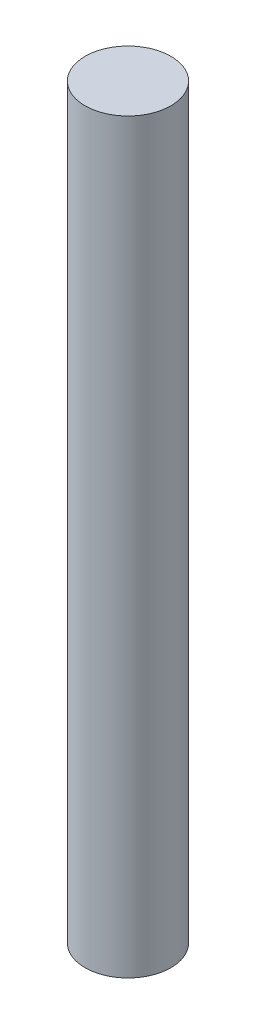
ISO-10303-21;
HEADER;
FILE_DESCRIPTION(('STEP AP214'),'2;1');
FILE_NAME('part.step','',(''),(''),'','','');
FILE_SCHEMA(('AUTOMOTIVE_DESIGN { 1 0 10303 214 1 1 1 1 }'));
ENDSEC;
DATA;
#1=APPLICATION_CONTEXT('core data for automotive mechanical design processes');
#2=APPLICATION_PROTOCOL_DEFINITION('international standard','automotive_design',2000,#1);
#3=PRODUCT_CONTEXT('',#1,'mechanical');
#4=PRODUCT('Part','Part','',(#3));
#5=PRODUCT_RELATED_PRODUCT_CATEGORY('part','',(#4));
#6=PRODUCT_DEFINITION_FORMATION('','',#4);
#7=PRODUCT_DEFINITION_CONTEXT('part definition',#1,'design');
#8=PRODUCT_DEFINITION('design','',#6,#7);
#9=PRODUCT_DEFINITION_SHAPE('','',#8);
#10=(LENGTH_UNIT() NAMED_UNIT(*) SI_UNIT(.MILLI.,.METRE.));
#11=(NAMED_UNIT(*) PLANE_ANGLE_UNIT() SI_UNIT($,.RADIAN.));
#12=(NAMED_UNIT(*) SI_UNIT($,.STERADIAN.) SOLID_ANGLE_UNIT());
#13=UNCERTAINTY_MEASURE_WITH_UNIT(LENGTH_MEASURE(1.E-05),#10,'distance_accuracy_value','');
#14=(GEOMETRIC_REPRESENTATION_CONTEXT(3) GLOBAL_UNCERTAINTY_ASSIGNED_CONTEXT((#13)) GLOBAL_UNIT_ASSIGNED_CONTEXT((#10,
#11,#12)) REPRESENTATION_CONTEXT('',''));
#15=CARTESIAN_POINT('',(0.,0.,0.));
#16=DIRECTION('',(0.,0.,1.));
#17=DIRECTION('',(1.,0.,0.));
#18=AXIS2_PLACEMENT_3D('',#15,#16,#17);
#19=CARTESIAN_POINT('',(0.,43.5,0.));
#20=DIRECTION('',(0.,-1.,0.));
#21=DIRECTION('',(0.,0.,-1.));
#22=AXIS2_PLACEMENT_3D('',#19,#20,#21);
#23=CYLINDRICAL_SURFACE('',#22,2.5);
#24=CARTESIAN_POINT('',(0.,43.5,0.));
#25=DIRECTION('',(0.,1.,0.));
#26=DIRECTION('',(0.,0.,1.));
#27=AXIS2_PLACEMENT_3D('',#24,#25,#26);
#28=CIRCLE('',#27,2.5);
#29=CARTESIAN_POINT('',(0.,43.5,2.5));
#30=VERTEX_POINT('',#29);
#31=EDGE_CURVE('E10',#30,#30,#28,.T.);
#32=ORIENTED_EDGE('',*,*,#31,.F.);
#33=EDGE_LOOP('',(#32));
#34=FACE_BOUND('',#33,.T.);
#35=CARTESIAN_POINT('',(0.,0.,0.));
#36=DIRECTION('',(0.,1.,0.));
#37=DIRECTION('',(0.,0.,1.));
#38=AXIS2_PLACEMENT_3D('',#35,#36,#37);
#39=CIRCLE('',#38,2.5);
#40=CARTESIAN_POINT('',(0.,0.,2.5));
#41=VERTEX_POINT('',#40);
#42=EDGE_CURVE('E35',#41,#41,#39,.T.);
#43=ORIENTED_EDGE('',*,*,#42,.T.);
#44=EDGE_LOOP('',(#43));
#45=FACE_BOUND('',#44,.T.);
#46=ADVANCED_FACE('F32',(#34,#45),#23,.T.);
#47=CARTESIAN_POINT('',(0.,43.5,0.));
#48=DIRECTION('',(0.,1.,0.));
#49=DIRECTION('',(0.,0.,1.));
#50=AXIS2_PLACEMENT_3D('',#47,#48,#49);
#51=PLANE('',#50);
#52=ORIENTED_EDGE('',*,*,#31,.T.);
#53=EDGE_LOOP('',(#52));
#54=FACE_BOUND('',#53,.T.);
#55=ADVANCED_FACE('F47',(#54),#51,.T.);
#56=CARTESIAN_POINT('',(0.,0.,0.));
#57=DIRECTION('',(0.,1.,0.));
#58=DIRECTION('',(0.,0.,1.));
#59=AXIS2_PLACEMENT_3D('',#56,#57,#58);
#60=PLANE('',#59);
#61=ORIENTED_EDGE('',*,*,#42,.F.);
#62=EDGE_LOOP('',(#61));
#63=FACE_BOUND('',#62,.T.);
#64=ADVANCED_FACE('F45',(#63),#60,.F.);
#65=CLOSED_SHELL('',(#46,#55,#64));
#66=MANIFOLD_SOLID_BREP('B2',#65);
#67=ADVANCED_BREP_SHAPE_REPRESENTATION('',(#18,#66),#14);
#68=SHAPE_DEFINITION_REPRESENTATION(#9,#67);
ENDSEC;
END-ISO-10303-21;
